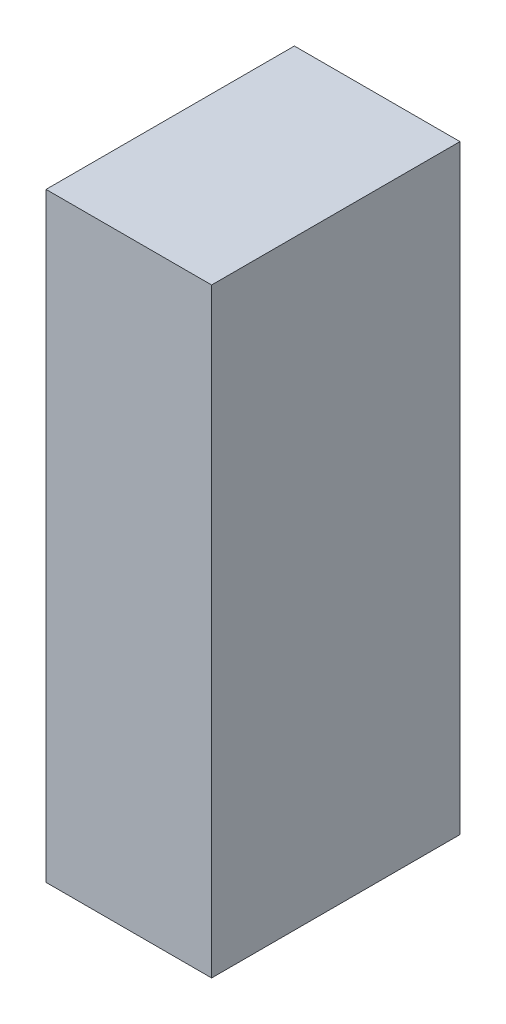
ISO-10303-21;
HEADER;
FILE_DESCRIPTION(('STEP AP214'),'2;1');
FILE_NAME('part.step','',(''),(''),'','','');
FILE_SCHEMA(('AUTOMOTIVE_DESIGN { 1 0 10303 214 1 1 1 1 }'));
ENDSEC;
DATA;
#1=APPLICATION_CONTEXT('core data for automotive mechanical design processes');
#2=APPLICATION_PROTOCOL_DEFINITION('international standard','automotive_design',2000,#1);
#3=PRODUCT_CONTEXT('',#1,'mechanical');
#4=PRODUCT('Part','Part','',(#3));
#5=PRODUCT_RELATED_PRODUCT_CATEGORY('part','',(#4));
#6=PRODUCT_DEFINITION_FORMATION('','',#4);
#7=PRODUCT_DEFINITION_CONTEXT('part definition',#1,'design');
#8=PRODUCT_DEFINITION('design','',#6,#7);
#9=PRODUCT_DEFINITION_SHAPE('','',#8);
#10=(LENGTH_UNIT() NAMED_UNIT(*) SI_UNIT(.MILLI.,.METRE.));
#11=(NAMED_UNIT(*) PLANE_ANGLE_UNIT() SI_UNIT($,.RADIAN.));
#12=(NAMED_UNIT(*) SI_UNIT($,.STERADIAN.) SOLID_ANGLE_UNIT());
#13=UNCERTAINTY_MEASURE_WITH_UNIT(LENGTH_MEASURE(1.E-05),#10,'distance_accuracy_value','');
#14=(GEOMETRIC_REPRESENTATION_CONTEXT(3) GLOBAL_UNCERTAINTY_ASSIGNED_CONTEXT((#13)) GLOBAL_UNIT_ASSIGNED_CONTEXT((#10,
#11,#12)) REPRESENTATION_CONTEXT('',''));
#15=CARTESIAN_POINT('',(0.,0.,0.));
#16=DIRECTION('',(0.,0.,1.));
#17=DIRECTION('',(1.,0.,0.));
#18=AXIS2_PLACEMENT_3D('',#15,#16,#17);
#19=CARTESIAN_POINT('',(-1.10000610351563,0.725006103515625,0.));
#20=DIRECTION('',(-1.,0.,0.));
#21=DIRECTION('',(0.,-1.,0.));
#22=AXIS2_PLACEMENT_3D('',#19,#20,#21);
#23=PLANE('',#22);
#24=DIRECTION('',(0.,-1.,0.));
#25=VECTOR('',#24,1.);
#26=CARTESIAN_POINT('',(-1.10000610351563,0.725006103515625,0.));
#27=LINE('',#26,#25);
#28=CARTESIAN_POINT('',(-1.10000610351563,0.725006103515625,0.));
#29=VERTEX_POINT('',#28);
#30=CARTESIAN_POINT('',(-1.10000610351563,-0.724998474121094,0.));
#31=VERTEX_POINT('',#30);
#32=EDGE_CURVE('E11',#29,#31,#27,.T.);
#33=ORIENTED_EDGE('',*,*,#32,.T.);
#34=DIRECTION('',(0.,0.,1.));
#35=VECTOR('',#34,1.);
#36=CARTESIAN_POINT('',(-1.10000610351563,-0.724998474121094,0.));
#37=LINE('',#36,#35);
#38=CARTESIAN_POINT('',(-1.10000610351563,-0.724998474121094,0.599998772144318));
#39=VERTEX_POINT('',#38);
#40=EDGE_CURVE('E88',#31,#39,#37,.T.);
#41=ORIENTED_EDGE('',*,*,#40,.T.);
#42=DIRECTION('',(0.,-1.,0.));
#43=VECTOR('',#42,1.);
#44=CARTESIAN_POINT('',(-1.10000610351563,0.725006103515625,0.599998772144318));
#45=LINE('',#44,#43);
#46=CARTESIAN_POINT('',(-1.10000610351563,0.725006103515625,0.599998772144318));
#47=VERTEX_POINT('',#46);
#48=EDGE_CURVE('E83',#47,#39,#45,.T.);
#49=ORIENTED_EDGE('',*,*,#48,.F.);
#50=DIRECTION('',(0.,0.,1.));
#51=VECTOR('',#50,1.);
#52=CARTESIAN_POINT('',(-1.10000610351563,0.725006103515625,0.));
#53=LINE('',#52,#51);
#54=EDGE_CURVE('E72',#29,#47,#53,.T.);
#55=ORIENTED_EDGE('',*,*,#54,.F.);
#56=EDGE_LOOP('',(#33,#41,#49,#55));
#57=FACE_BOUND('',#56,.T.);
#58=ADVANCED_FACE('F17',(#57),#23,.T.);
#59=CARTESIAN_POINT('',(-1.10000610351563,-0.724998474121094,0.));
#60=DIRECTION('',(0.,-1.,0.));
#61=DIRECTION('',(1.,0.,0.));
#62=AXIS2_PLACEMENT_3D('',#59,#60,#61);
#63=PLANE('',#62);
#64=DIRECTION('',(1.,0.,0.));
#65=VECTOR('',#64,1.);
#66=CARTESIAN_POINT('',(-1.10000610351563,-0.724998474121094,0.));
#67=LINE('',#66,#65);
#68=CARTESIAN_POINT('',(-0.699981689453125,-0.724998474121094,0.));
#69=VERTEX_POINT('',#68);
#70=EDGE_CURVE('E24',#31,#69,#67,.T.);
#71=ORIENTED_EDGE('',*,*,#70,.T.);
#72=DIRECTION('',(0.,0.,1.));
#73=VECTOR('',#72,1.);
#74=CARTESIAN_POINT('',(-0.699981689453125,-0.724998474121094,0.));
#75=LINE('',#74,#73);
#76=CARTESIAN_POINT('',(-0.699981689453125,-0.724998474121094,0.599998772144318));
#77=VERTEX_POINT('',#76);
#78=EDGE_CURVE('E85',#69,#77,#75,.T.);
#79=ORIENTED_EDGE('',*,*,#78,.T.);
#80=DIRECTION('',(1.,0.,0.));
#81=VECTOR('',#80,1.);
#82=CARTESIAN_POINT('',(-1.10000610351563,-0.724998474121094,0.599998772144318));
#83=LINE('',#82,#81);
#84=EDGE_CURVE('E66',#39,#77,#83,.T.);
#85=ORIENTED_EDGE('',*,*,#84,.F.);
#86=ORIENTED_EDGE('',*,*,#40,.F.);
#87=EDGE_LOOP('',(#71,#79,#85,#86));
#88=FACE_BOUND('',#87,.T.);
#89=ADVANCED_FACE('F89',(#88),#63,.T.);
#90=CARTESIAN_POINT('',(-0.699981689453125,-0.724998474121094,0.));
#91=DIRECTION('',(1.,0.,0.));
#92=DIRECTION('',(0.,1.,0.));
#93=AXIS2_PLACEMENT_3D('',#90,#91,#92);
#94=PLANE('',#93);
#95=DIRECTION('',(0.,1.,0.));
#96=VECTOR('',#95,1.);
#97=CARTESIAN_POINT('',(-0.699981689453125,-0.724998474121094,0.));
#98=LINE('',#97,#96);
#99=CARTESIAN_POINT('',(-0.699981689453125,0.725006103515625,0.));
#100=VERTEX_POINT('',#99);
#101=EDGE_CURVE('E62',#69,#100,#98,.T.);
#102=ORIENTED_EDGE('',*,*,#101,.T.);
#103=DIRECTION('',(0.,0.,1.));
#104=VECTOR('',#103,1.);
#105=CARTESIAN_POINT('',(-0.699981689453125,0.725006103515625,0.));
#106=LINE('',#105,#104);
#107=CARTESIAN_POINT('',(-0.699981689453125,0.725006103515625,0.599998772144318));
#108=VERTEX_POINT('',#107);
#109=EDGE_CURVE('E55',#100,#108,#106,.T.);
#110=ORIENTED_EDGE('',*,*,#109,.T.);
#111=DIRECTION('',(0.,1.,0.));
#112=VECTOR('',#111,1.);
#113=CARTESIAN_POINT('',(-0.699981689453125,-0.724998474121094,0.599998772144318));
#114=LINE('',#113,#112);
#115=EDGE_CURVE('E59',#77,#108,#114,.T.);
#116=ORIENTED_EDGE('',*,*,#115,.F.);
#117=ORIENTED_EDGE('',*,*,#78,.F.);
#118=EDGE_LOOP('',(#102,#110,#116,#117));
#119=FACE_BOUND('',#118,.T.);
#120=ADVANCED_FACE('F57',(#119),#94,.T.);
#121=CARTESIAN_POINT('',(-0.699981689453125,0.725006103515625,0.));
#122=DIRECTION('',(0.,1.,0.));
#123=DIRECTION('',(-1.,0.,0.));
#124=AXIS2_PLACEMENT_3D('',#121,#122,#123);
#125=PLANE('',#124);
#126=DIRECTION('',(-1.,0.,0.));
#127=VECTOR('',#126,1.);
#128=CARTESIAN_POINT('',(-0.699981689453125,0.725006103515625,0.));
#129=LINE('',#128,#127);
#130=EDGE_CURVE('E65',#100,#29,#129,.T.);
#131=ORIENTED_EDGE('',*,*,#130,.T.);
#132=ORIENTED_EDGE('',*,*,#54,.T.);
#133=DIRECTION('',(-1.,0.,0.));
#134=VECTOR('',#133,1.);
#135=CARTESIAN_POINT('',(-0.699981689453125,0.725006103515625,0.599998772144318));
#136=LINE('',#135,#134);
#137=EDGE_CURVE('E70',#108,#47,#136,.T.);
#138=ORIENTED_EDGE('',*,*,#137,.F.);
#139=ORIENTED_EDGE('',*,*,#109,.F.);
#140=EDGE_LOOP('',(#131,#132,#138,#139));
#141=FACE_BOUND('',#140,.T.);
#142=ADVANCED_FACE('F71',(#141),#125,.T.);
#143=CARTESIAN_POINT('',(-489.75,-105.025001525879,0.599998772144318));
#144=DIRECTION('',(0.,0.,1.));
#145=DIRECTION('',(1.,0.,0.));
#146=AXIS2_PLACEMENT_3D('',#143,#144,#145);
#147=PLANE('',#146);
#148=ORIENTED_EDGE('',*,*,#48,.T.);
#149=ORIENTED_EDGE('',*,*,#84,.T.);
#150=ORIENTED_EDGE('',*,*,#115,.T.);
#151=ORIENTED_EDGE('',*,*,#137,.T.);
#152=EDGE_LOOP('',(#148,#149,#150,#151));
#153=FACE_BOUND('',#152,.T.);
#154=ADVANCED_FACE('F76',(#153),#147,.T.);
#155=CARTESIAN_POINT('',(-489.75,-105.025001525879,0.));
#156=DIRECTION('',(0.,0.,1.));
#157=DIRECTION('',(1.,0.,0.));
#158=AXIS2_PLACEMENT_3D('',#155,#156,#157);
#159=PLANE('',#158);
#160=ORIENTED_EDGE('',*,*,#130,.F.);
#161=ORIENTED_EDGE('',*,*,#101,.F.);
#162=ORIENTED_EDGE('',*,*,#70,.F.);
#163=ORIENTED_EDGE('',*,*,#32,.F.);
#164=EDGE_LOOP('',(#160,#161,#162,#163));
#165=FACE_BOUND('',#164,.T.);
#166=ADVANCED_FACE('F91',(#165),#159,.F.);
#167=CLOSED_SHELL('',(#58,#89,#120,#142,#154,#166));
#168=MANIFOLD_SOLID_BREP('B1',#167);
#169=ADVANCED_BREP_SHAPE_REPRESENTATION('',(#18,#168),#14);
#170=SHAPE_DEFINITION_REPRESENTATION(#9,#169);
ENDSEC;
END-ISO-10303-21;
